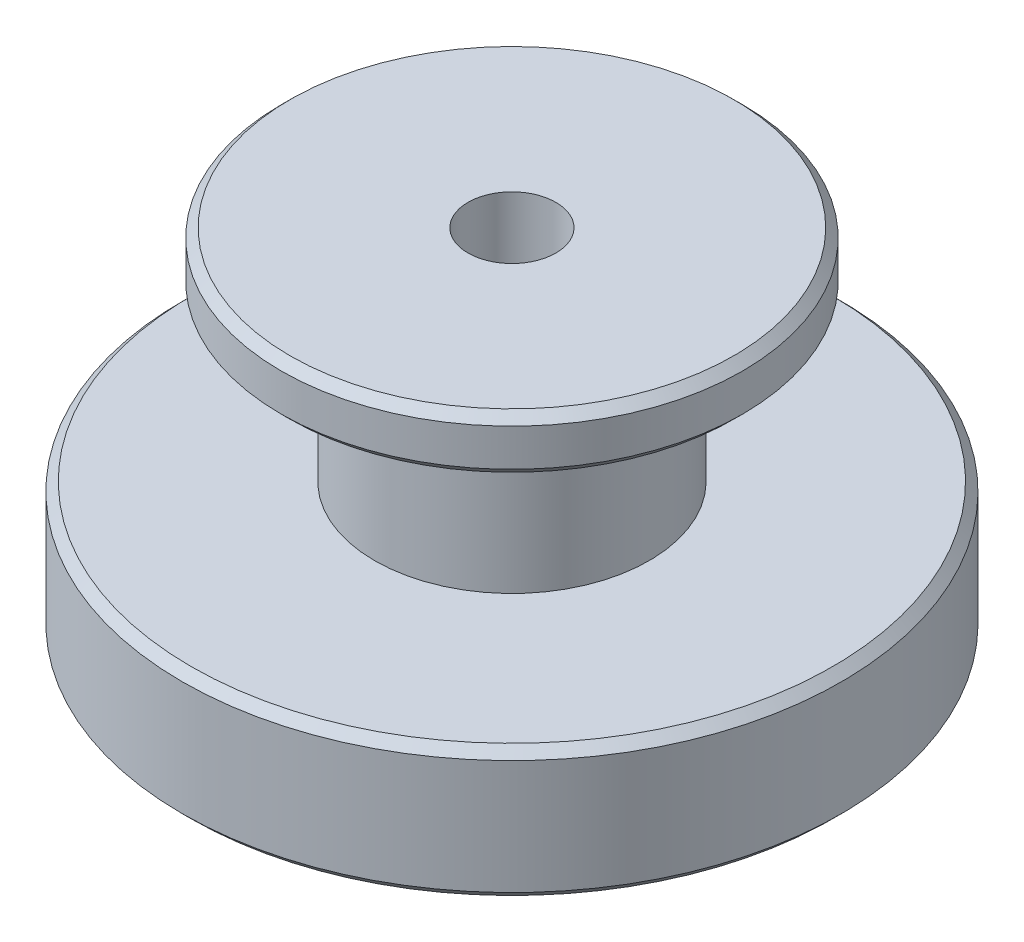
ISO-10303-21;
HEADER;
FILE_DESCRIPTION(('STEP AP214'),'2;1');
FILE_NAME('part.step','',(''),(''),'','','');
FILE_SCHEMA(('AUTOMOTIVE_DESIGN { 1 0 10303 214 1 1 1 1 }'));
ENDSEC;
DATA;
#1=APPLICATION_CONTEXT('core data for automotive mechanical design processes');
#2=APPLICATION_PROTOCOL_DEFINITION('international standard','automotive_design',2000,#1);
#3=PRODUCT_CONTEXT('',#1,'mechanical');
#4=PRODUCT('Part','Part','',(#3));
#5=PRODUCT_RELATED_PRODUCT_CATEGORY('part','',(#4));
#6=PRODUCT_DEFINITION_FORMATION('','',#4);
#7=PRODUCT_DEFINITION_CONTEXT('part definition',#1,'design');
#8=PRODUCT_DEFINITION('design','',#6,#7);
#9=PRODUCT_DEFINITION_SHAPE('','',#8);
#10=(LENGTH_UNIT() NAMED_UNIT(*) SI_UNIT(.MILLI.,.METRE.));
#11=(NAMED_UNIT(*) PLANE_ANGLE_UNIT() SI_UNIT($,.RADIAN.));
#12=(NAMED_UNIT(*) SI_UNIT($,.STERADIAN.) SOLID_ANGLE_UNIT());
#13=UNCERTAINTY_MEASURE_WITH_UNIT(LENGTH_MEASURE(1.E-05),#10,'distance_accuracy_value','');
#14=(GEOMETRIC_REPRESENTATION_CONTEXT(3) GLOBAL_UNCERTAINTY_ASSIGNED_CONTEXT((#13)) GLOBAL_UNIT_ASSIGNED_CONTEXT((#10,
#11,#12)) REPRESENTATION_CONTEXT('',''));
#15=CARTESIAN_POINT('',(0.,0.,0.));
#16=DIRECTION('',(0.,0.,1.));
#17=DIRECTION('',(1.,0.,0.));
#18=AXIS2_PLACEMENT_3D('',#15,#16,#17);
#19=CARTESIAN_POINT('',(0.,175.803710108865,0.));
#20=DIRECTION('',(0.,1.,0.));
#21=DIRECTION('',(0.,0.,1.));
#22=AXIS2_PLACEMENT_3D('',#19,#20,#21);
#23=CYLINDRICAL_SURFACE('',#22,4.00000000000002);
#24=CARTESIAN_POINT('',(0.,0.,0.));
#25=DIRECTION('',(0.,1.,0.));
#26=DIRECTION('',(0.,0.,1.));
#27=AXIS2_PLACEMENT_3D('',#24,#25,#26);
#28=CIRCLE('',#27,4.00000000000002);
#29=CARTESIAN_POINT('',(0.,0.,4.00000000000002));
#30=VERTEX_POINT('',#29);
#31=EDGE_CURVE('E10',#30,#30,#28,.T.);
#32=ORIENTED_EDGE('',*,*,#31,.F.);
#33=EDGE_LOOP('',(#32));
#34=FACE_BOUND('',#33,.T.);
#35=CARTESIAN_POINT('',(0.,32.,0.));
#36=DIRECTION('',(0.,1.,0.));
#37=DIRECTION('',(0.,0.,1.));
#38=AXIS2_PLACEMENT_3D('',#35,#36,#37);
#39=CIRCLE('',#38,4.00000000000002);
#40=CARTESIAN_POINT('',(0.,32.,4.00000000000002));
#41=VERTEX_POINT('',#40);
#42=EDGE_CURVE('E72',#41,#41,#39,.T.);
#43=ORIENTED_EDGE('',*,*,#42,.T.);
#44=EDGE_LOOP('',(#43));
#45=FACE_BOUND('',#44,.T.);
#46=ADVANCED_FACE('F32',(#34,#45),#23,.F.);
#47=CARTESIAN_POINT('',(4.00000000000002,0.,0.));
#48=DIRECTION('',(0.,1.,0.));
#49=DIRECTION('',(0.,0.,1.));
#50=AXIS2_PLACEMENT_3D('',#47,#48,#49);
#51=PLANE('',#50);
#52=CARTESIAN_POINT('',(0.,0.,0.));
#53=DIRECTION('',(0.,1.,0.));
#54=DIRECTION('',(0.,0.,1.));
#55=AXIS2_PLACEMENT_3D('',#52,#53,#54);
#56=CIRCLE('',#55,29.2);
#57=CARTESIAN_POINT('',(0.,0.,29.2));
#58=VERTEX_POINT('',#57);
#59=EDGE_CURVE('E38',#58,#58,#56,.T.);
#60=ORIENTED_EDGE('',*,*,#59,.F.);
#61=EDGE_LOOP('',(#60));
#62=FACE_BOUND('',#61,.T.);
#63=ORIENTED_EDGE('',*,*,#31,.T.);
#64=EDGE_LOOP('',(#63));
#65=FACE_BOUND('',#64,.T.);
#66=ADVANCED_FACE('F133',(#62,#65),#51,.F.);
#67=CARTESIAN_POINT('',(0.,0.,0.));
#68=DIRECTION('',(0.,1.,0.));
#69=DIRECTION('',(0.,0.,1.));
#70=AXIS2_PLACEMENT_3D('',#67,#68,#69);
#71=CONICAL_SURFACE('',#70,29.2,0.78539816339745);
#72=CARTESIAN_POINT('',(0.,0.799999999999995,0.));
#73=DIRECTION('',(0.,1.,0.));
#74=DIRECTION('',(0.,0.,1.));
#75=AXIS2_PLACEMENT_3D('',#72,#73,#74);
#76=CIRCLE('',#75,30.);
#77=CARTESIAN_POINT('',(0.,0.799999999999995,30.));
#78=VERTEX_POINT('',#77);
#79=EDGE_CURVE('E42',#78,#78,#76,.T.);
#80=ORIENTED_EDGE('',*,*,#79,.F.);
#81=EDGE_LOOP('',(#80));
#82=FACE_BOUND('',#81,.T.);
#83=ORIENTED_EDGE('',*,*,#59,.T.);
#84=EDGE_LOOP('',(#83));
#85=FACE_BOUND('',#84,.T.);
#86=ADVANCED_FACE('F128',(#82,#85),#71,.T.);
#87=CARTESIAN_POINT('',(0.,175.803710108865,0.));
#88=DIRECTION('',(0.,1.,0.));
#89=DIRECTION('',(0.,0.,1.));
#90=AXIS2_PLACEMENT_3D('',#87,#88,#89);
#91=CYLINDRICAL_SURFACE('',#90,30.);
#92=CARTESIAN_POINT('',(0.,11.2,0.));
#93=DIRECTION('',(0.,1.,0.));
#94=DIRECTION('',(0.,0.,1.));
#95=AXIS2_PLACEMENT_3D('',#92,#93,#94);
#96=CIRCLE('',#95,30.);
#97=CARTESIAN_POINT('',(0.,11.2,30.));
#98=VERTEX_POINT('',#97);
#99=EDGE_CURVE('E46',#98,#98,#96,.T.);
#100=ORIENTED_EDGE('',*,*,#99,.F.);
#101=EDGE_LOOP('',(#100));
#102=FACE_BOUND('',#101,.T.);
#103=ORIENTED_EDGE('',*,*,#79,.T.);
#104=EDGE_LOOP('',(#103));
#105=FACE_BOUND('',#104,.T.);
#106=ADVANCED_FACE('F122',(#102,#105),#91,.T.);
#107=CARTESIAN_POINT('',(0.,11.2,0.));
#108=DIRECTION('',(0.,-1.,0.));
#109=DIRECTION('',(0.,0.,-1.));
#110=AXIS2_PLACEMENT_3D('',#107,#108,#109);
#111=CONICAL_SURFACE('',#110,30.,0.78539816339745);
#112=CARTESIAN_POINT('',(0.,12.,0.));
#113=DIRECTION('',(0.,1.,0.));
#114=DIRECTION('',(0.,0.,1.));
#115=AXIS2_PLACEMENT_3D('',#112,#113,#114);
#116=CIRCLE('',#115,29.2);
#117=CARTESIAN_POINT('',(0.,12.,29.2));
#118=VERTEX_POINT('',#117);
#119=EDGE_CURVE('E51',#118,#118,#116,.T.);
#120=ORIENTED_EDGE('',*,*,#119,.F.);
#121=EDGE_LOOP('',(#120));
#122=FACE_BOUND('',#121,.T.);
#123=ORIENTED_EDGE('',*,*,#99,.T.);
#124=EDGE_LOOP('',(#123));
#125=FACE_BOUND('',#124,.T.);
#126=ADVANCED_FACE('F116',(#122,#125),#111,.T.);
#127=CARTESIAN_POINT('',(29.2,12.,0.));
#128=DIRECTION('',(0.,-1.,0.));
#129=DIRECTION('',(0.,0.,-1.));
#130=AXIS2_PLACEMENT_3D('',#127,#128,#129);
#131=PLANE('',#130);
#132=CARTESIAN_POINT('',(0.,12.,0.));
#133=DIRECTION('',(0.,1.,0.));
#134=DIRECTION('',(0.,0.,1.));
#135=AXIS2_PLACEMENT_3D('',#132,#133,#134);
#136=CIRCLE('',#135,12.5);
#137=CARTESIAN_POINT('',(0.,12.,12.5));
#138=VERTEX_POINT('',#137);
#139=EDGE_CURVE('E54',#138,#138,#136,.T.);
#140=ORIENTED_EDGE('',*,*,#139,.F.);
#141=EDGE_LOOP('',(#140));
#142=FACE_BOUND('',#141,.T.);
#143=ORIENTED_EDGE('',*,*,#119,.T.);
#144=EDGE_LOOP('',(#143));
#145=FACE_BOUND('',#144,.T.);
#146=ADVANCED_FACE('F110',(#142,#145),#131,.F.);
#147=CARTESIAN_POINT('',(0.,175.803710108865,0.));
#148=DIRECTION('',(0.,1.,0.));
#149=DIRECTION('',(0.,0.,1.));
#150=AXIS2_PLACEMENT_3D('',#147,#148,#149);
#151=CYLINDRICAL_SURFACE('',#150,12.5);
#152=CARTESIAN_POINT('',(0.,27.,0.));
#153=DIRECTION('',(0.,1.,0.));
#154=DIRECTION('',(0.,0.,1.));
#155=AXIS2_PLACEMENT_3D('',#152,#153,#154);
#156=CIRCLE('',#155,12.5);
#157=CARTESIAN_POINT('',(0.,27.,12.5));
#158=VERTEX_POINT('',#157);
#159=EDGE_CURVE('E57',#158,#158,#156,.T.);
#160=ORIENTED_EDGE('',*,*,#159,.F.);
#161=EDGE_LOOP('',(#160));
#162=FACE_BOUND('',#161,.T.);
#163=ORIENTED_EDGE('',*,*,#139,.T.);
#164=EDGE_LOOP('',(#163));
#165=FACE_BOUND('',#164,.T.);
#166=ADVANCED_FACE('F104',(#162,#165),#151,.T.);
#167=CARTESIAN_POINT('',(12.5,27.,0.));
#168=DIRECTION('',(0.,1.,0.));
#169=DIRECTION('',(0.,0.,1.));
#170=AXIS2_PLACEMENT_3D('',#167,#168,#169);
#171=PLANE('',#170);
#172=CARTESIAN_POINT('',(0.,27.,0.));
#173=DIRECTION('',(0.,1.,0.));
#174=DIRECTION('',(0.,0.,1.));
#175=AXIS2_PLACEMENT_3D('',#172,#173,#174);
#176=CIRCLE('',#175,20.2);
#177=CARTESIAN_POINT('',(0.,27.,20.2));
#178=VERTEX_POINT('',#177);
#179=EDGE_CURVE('E60',#178,#178,#176,.T.);
#180=ORIENTED_EDGE('',*,*,#179,.F.);
#181=EDGE_LOOP('',(#180));
#182=FACE_BOUND('',#181,.T.);
#183=ORIENTED_EDGE('',*,*,#159,.T.);
#184=EDGE_LOOP('',(#183));
#185=FACE_BOUND('',#184,.T.);
#186=ADVANCED_FACE('F98',(#182,#185),#171,.F.);
#187=CARTESIAN_POINT('',(0.,27.,0.));
#188=DIRECTION('',(0.,1.,0.));
#189=DIRECTION('',(0.,0.,1.));
#190=AXIS2_PLACEMENT_3D('',#187,#188,#189);
#191=CONICAL_SURFACE('',#190,20.2,0.78539816339745);
#192=CARTESIAN_POINT('',(0.,27.8,0.));
#193=DIRECTION('',(0.,1.,0.));
#194=DIRECTION('',(0.,0.,1.));
#195=AXIS2_PLACEMENT_3D('',#192,#193,#194);
#196=CIRCLE('',#195,21.);
#197=CARTESIAN_POINT('',(0.,27.8,21.));
#198=VERTEX_POINT('',#197);
#199=EDGE_CURVE('E63',#198,#198,#196,.T.);
#200=ORIENTED_EDGE('',*,*,#199,.F.);
#201=EDGE_LOOP('',(#200));
#202=FACE_BOUND('',#201,.T.);
#203=ORIENTED_EDGE('',*,*,#179,.T.);
#204=EDGE_LOOP('',(#203));
#205=FACE_BOUND('',#204,.T.);
#206=ADVANCED_FACE('F92',(#202,#205),#191,.T.);
#207=CARTESIAN_POINT('',(0.,175.803710108865,0.));
#208=DIRECTION('',(0.,1.,0.));
#209=DIRECTION('',(0.,0.,1.));
#210=AXIS2_PLACEMENT_3D('',#207,#208,#209);
#211=CYLINDRICAL_SURFACE('',#210,21.);
#212=CARTESIAN_POINT('',(0.,31.2,0.));
#213=DIRECTION('',(0.,1.,0.));
#214=DIRECTION('',(0.,0.,1.));
#215=AXIS2_PLACEMENT_3D('',#212,#213,#214);
#216=CIRCLE('',#215,21.);
#217=CARTESIAN_POINT('',(0.,31.2,21.));
#218=VERTEX_POINT('',#217);
#219=EDGE_CURVE('E66',#218,#218,#216,.T.);
#220=ORIENTED_EDGE('',*,*,#219,.F.);
#221=EDGE_LOOP('',(#220));
#222=FACE_BOUND('',#221,.T.);
#223=ORIENTED_EDGE('',*,*,#199,.T.);
#224=EDGE_LOOP('',(#223));
#225=FACE_BOUND('',#224,.T.);
#226=ADVANCED_FACE('F86',(#222,#225),#211,.T.);
#227=CARTESIAN_POINT('',(0.,31.2,0.));
#228=DIRECTION('',(0.,-1.,0.));
#229=DIRECTION('',(0.,0.,-1.));
#230=AXIS2_PLACEMENT_3D('',#227,#228,#229);
#231=CONICAL_SURFACE('',#230,21.,0.785398163397448);
#232=CARTESIAN_POINT('',(0.,32.,0.));
#233=DIRECTION('',(0.,1.,0.));
#234=DIRECTION('',(0.,0.,1.));
#235=AXIS2_PLACEMENT_3D('',#232,#233,#234);
#236=CIRCLE('',#235,20.2);
#237=CARTESIAN_POINT('',(0.,32.,20.2));
#238=VERTEX_POINT('',#237);
#239=EDGE_CURVE('E69',#238,#238,#236,.T.);
#240=ORIENTED_EDGE('',*,*,#239,.F.);
#241=EDGE_LOOP('',(#240));
#242=FACE_BOUND('',#241,.T.);
#243=ORIENTED_EDGE('',*,*,#219,.T.);
#244=EDGE_LOOP('',(#243));
#245=FACE_BOUND('',#244,.T.);
#246=ADVANCED_FACE('F80',(#242,#245),#231,.T.);
#247=CARTESIAN_POINT('',(20.2,32.,0.));
#248=DIRECTION('',(0.,-1.,0.));
#249=DIRECTION('',(0.,0.,-1.));
#250=AXIS2_PLACEMENT_3D('',#247,#248,#249);
#251=PLANE('',#250);
#252=ORIENTED_EDGE('',*,*,#42,.F.);
#253=EDGE_LOOP('',(#252));
#254=FACE_BOUND('',#253,.T.);
#255=ORIENTED_EDGE('',*,*,#239,.T.);
#256=EDGE_LOOP('',(#255));
#257=FACE_BOUND('',#256,.T.);
#258=ADVANCED_FACE('F77',(#254,#257),#251,.F.);
#259=CLOSED_SHELL('',(#46,#66,#86,#106,#126,#146,#166,#186,#206,#226,#246,#258));
#260=MANIFOLD_SOLID_BREP('B2',#259);
#261=ADVANCED_BREP_SHAPE_REPRESENTATION('',(#18,#260),#14);
#262=SHAPE_DEFINITION_REPRESENTATION(#9,#261);
ENDSEC;
END-ISO-10303-21;
